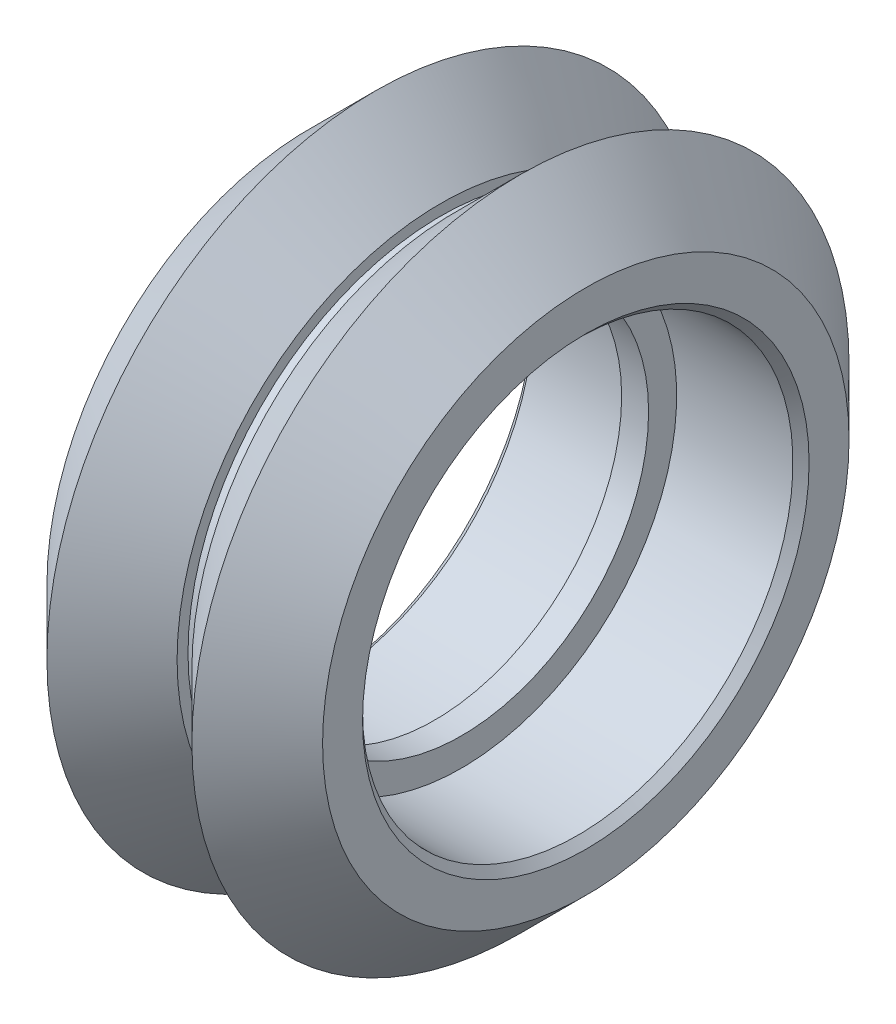
ISO-10303-21;
HEADER;
FILE_DESCRIPTION(('STEP AP214'),'2;1');
FILE_NAME('part.step','',(''),(''),'','','');
FILE_SCHEMA(('AUTOMOTIVE_DESIGN { 1 0 10303 214 1 1 1 1 }'));
ENDSEC;
DATA;
#1=APPLICATION_CONTEXT('core data for automotive mechanical design processes');
#2=APPLICATION_PROTOCOL_DEFINITION('international standard','automotive_design',2000,#1);
#3=PRODUCT_CONTEXT('',#1,'mechanical');
#4=PRODUCT('Part','Part','',(#3));
#5=PRODUCT_RELATED_PRODUCT_CATEGORY('part','',(#4));
#6=PRODUCT_DEFINITION_FORMATION('','',#4);
#7=PRODUCT_DEFINITION_CONTEXT('part definition',#1,'design');
#8=PRODUCT_DEFINITION('design','',#6,#7);
#9=PRODUCT_DEFINITION_SHAPE('','',#8);
#10=(LENGTH_UNIT() NAMED_UNIT(*) SI_UNIT(.MILLI.,.METRE.));
#11=(NAMED_UNIT(*) PLANE_ANGLE_UNIT() SI_UNIT($,.RADIAN.));
#12=(NAMED_UNIT(*) SI_UNIT($,.STERADIAN.) SOLID_ANGLE_UNIT());
#13=UNCERTAINTY_MEASURE_WITH_UNIT(LENGTH_MEASURE(1.E-05),#10,'distance_accuracy_value','');
#14=(GEOMETRIC_REPRESENTATION_CONTEXT(3) GLOBAL_UNCERTAINTY_ASSIGNED_CONTEXT((#13)) GLOBAL_UNIT_ASSIGNED_CONTEXT((#10,
#11,#12)) REPRESENTATION_CONTEXT('',''));
#15=CARTESIAN_POINT('',(0.,0.,0.));
#16=DIRECTION('',(0.,0.,1.));
#17=DIRECTION('',(1.,0.,0.));
#18=AXIS2_PLACEMENT_3D('',#15,#16,#17);
#19=CARTESIAN_POINT('',(0.5,7.987,0.));
#20=DIRECTION('',(-1.,0.,0.));
#21=DIRECTION('',(0.,0.,1.));
#22=AXIS2_PLACEMENT_3D('',#19,#20,#21);
#23=PLANE('',#22);
#24=CARTESIAN_POINT('',(0.5,0.,0.));
#25=DIRECTION('',(-1.,0.,0.));
#26=DIRECTION('',(0.,0.,1.));
#27=AXIS2_PLACEMENT_3D('',#24,#25,#26);
#28=CIRCLE('',#27,7.987);
#29=CARTESIAN_POINT('',(0.5,0.,7.987));
#30=VERTEX_POINT('',#29);
#31=EDGE_CURVE('E83',#30,#30,#28,.T.);
#32=ORIENTED_EDGE('',*,*,#31,.F.);
#33=EDGE_LOOP('',(#32));
#34=FACE_BOUND('',#33,.T.);
#35=CARTESIAN_POINT('',(0.5,0.,0.));
#36=DIRECTION('',(-1.,0.,0.));
#37=DIRECTION('',(0.,0.,1.));
#38=AXIS2_PLACEMENT_3D('',#35,#36,#37);
#39=CIRCLE('',#38,6.945);
#40=CARTESIAN_POINT('',(0.5,0.,6.945));
#41=VERTEX_POINT('',#40);
#42=EDGE_CURVE('E50',#41,#41,#39,.T.);
#43=ORIENTED_EDGE('',*,*,#42,.T.);
#44=EDGE_LOOP('',(#43));
#45=FACE_BOUND('',#44,.T.);
#46=ADVANCED_FACE('F30',(#34,#45),#23,.F.);
#47=CARTESIAN_POINT('',(0.,0.,0.));
#48=DIRECTION('',(-1.,0.,0.));
#49=DIRECTION('',(0.,0.,1.));
#50=AXIS2_PLACEMENT_3D('',#47,#48,#49);
#51=CYLINDRICAL_SURFACE('',#50,6.945);
#52=ORIENTED_EDGE('',*,*,#42,.F.);
#53=EDGE_LOOP('',(#52));
#54=FACE_BOUND('',#53,.T.);
#55=CARTESIAN_POINT('',(-0.5,0.,0.));
#56=DIRECTION('',(-1.,0.,0.));
#57=DIRECTION('',(0.,0.,1.));
#58=AXIS2_PLACEMENT_3D('',#55,#56,#57);
#59=CIRCLE('',#58,6.945);
#60=CARTESIAN_POINT('',(-0.5,0.,6.945));
#61=VERTEX_POINT('',#60);
#62=EDGE_CURVE('E53',#61,#61,#59,.T.);
#63=ORIENTED_EDGE('',*,*,#62,.T.);
#64=EDGE_LOOP('',(#63));
#65=FACE_BOUND('',#64,.T.);
#66=ADVANCED_FACE('F91',(#54,#65),#51,.F.);
#67=CARTESIAN_POINT('',(-0.5,6.945,0.));
#68=DIRECTION('',(1.,0.,0.));
#69=DIRECTION('',(0.,0.,-1.));
#70=AXIS2_PLACEMENT_3D('',#67,#68,#69);
#71=PLANE('',#70);
#72=ORIENTED_EDGE('',*,*,#62,.F.);
#73=EDGE_LOOP('',(#72));
#74=FACE_BOUND('',#73,.T.);
#75=CARTESIAN_POINT('',(-0.5,0.,0.));
#76=DIRECTION('',(-1.,0.,0.));
#77=DIRECTION('',(0.,0.,1.));
#78=AXIS2_PLACEMENT_3D('',#75,#76,#77);
#79=CIRCLE('',#78,7.987);
#80=CARTESIAN_POINT('',(-0.5,0.,7.987));
#81=VERTEX_POINT('',#80);
#82=EDGE_CURVE('E56',#81,#81,#79,.T.);
#83=ORIENTED_EDGE('',*,*,#82,.T.);
#84=EDGE_LOOP('',(#83));
#85=FACE_BOUND('',#84,.T.);
#86=ADVANCED_FACE('F97',(#74,#85),#71,.F.);
#87=CARTESIAN_POINT('',(0.,0.,0.));
#88=DIRECTION('',(-1.,0.,0.));
#89=DIRECTION('',(0.,0.,1.));
#90=AXIS2_PLACEMENT_3D('',#87,#88,#89);
#91=CYLINDRICAL_SURFACE('',#90,7.987);
#92=CARTESIAN_POINT('',(-4.815,0.,0.));
#93=DIRECTION('',(1.,0.,0.));
#94=DIRECTION('',(0.,0.,-1.));
#95=AXIS2_PLACEMENT_3D('',#92,#93,#94);
#96=CIRCLE('',#95,7.987);
#97=CARTESIAN_POINT('',(-4.815,0.,-7.987));
#98=VERTEX_POINT('',#97);
#99=EDGE_CURVE('E37',#98,#98,#96,.F.);
#100=ORIENTED_EDGE('',*,*,#99,.T.);
#101=EDGE_LOOP('',(#100));
#102=FACE_BOUND('',#101,.T.);
#103=ORIENTED_EDGE('',*,*,#82,.F.);
#104=EDGE_LOOP('',(#103));
#105=FACE_BOUND('',#104,.T.);
#106=ADVANCED_FACE('F103',(#102,#105),#91,.F.);
#107=CARTESIAN_POINT('',(-5.115,7.987,0.));
#108=DIRECTION('',(1.,0.,0.));
#109=DIRECTION('',(0.,0.,-1.));
#110=AXIS2_PLACEMENT_3D('',#107,#108,#109);
#111=PLANE('',#110);
#112=CARTESIAN_POINT('',(-5.115,0.,0.));
#113=DIRECTION('',(1.,0.,0.));
#114=DIRECTION('',(0.,0.,-1.));
#115=AXIS2_PLACEMENT_3D('',#112,#113,#114);
#116=CIRCLE('',#115,8.287);
#117=CARTESIAN_POINT('',(-5.115,0.,-8.287));
#118=VERTEX_POINT('',#117);
#119=EDGE_CURVE('E10',#118,#118,#116,.T.);
#120=ORIENTED_EDGE('',*,*,#119,.T.);
#121=EDGE_LOOP('',(#120));
#122=FACE_BOUND('',#121,.T.);
#123=CARTESIAN_POINT('',(-5.115,0.,0.));
#124=DIRECTION('',(-1.,0.,0.));
#125=DIRECTION('',(0.,0.,1.));
#126=AXIS2_PLACEMENT_3D('',#123,#124,#125);
#127=CIRCLE('',#126,9.77);
#128=CARTESIAN_POINT('',(-5.115,0.,9.77));
#129=VERTEX_POINT('',#128);
#130=EDGE_CURVE('E59',#129,#129,#127,.T.);
#131=ORIENTED_EDGE('',*,*,#130,.T.);
#132=EDGE_LOOP('',(#131));
#133=FACE_BOUND('',#132,.T.);
#134=ADVANCED_FACE('F108',(#122,#133),#111,.F.);
#135=CARTESIAN_POINT('',(-2.68999999999999,0.,0.));
#136=DIRECTION('',(1.,0.,0.));
#137=DIRECTION('',(0.,0.,-1.));
#138=AXIS2_PLACEMENT_3D('',#135,#136,#137);
#139=CONICAL_SURFACE('',#138,12.195,0.785398163397446);
#140=ORIENTED_EDGE('',*,*,#130,.F.);
#141=EDGE_LOOP('',(#140));
#142=FACE_BOUND('',#141,.T.);
#143=CARTESIAN_POINT('',(-2.68999999999999,0.,0.));
#144=DIRECTION('',(-1.,0.,0.));
#145=DIRECTION('',(0.,0.,1.));
#146=AXIS2_PLACEMENT_3D('',#143,#144,#145);
#147=CIRCLE('',#146,12.195);
#148=CARTESIAN_POINT('',(-2.68999999999999,0.,12.195));
#149=VERTEX_POINT('',#148);
#150=EDGE_CURVE('E62',#149,#149,#147,.T.);
#151=ORIENTED_EDGE('',*,*,#150,.T.);
#152=EDGE_LOOP('',(#151));
#153=FACE_BOUND('',#152,.T.);
#154=ADVANCED_FACE('F113',(#142,#153),#139,.T.);
#155=CARTESIAN_POINT('',(-0.275,0.,0.));
#156=DIRECTION('',(-1.,0.,0.));
#157=DIRECTION('',(0.,0.,1.));
#158=AXIS2_PLACEMENT_3D('',#155,#156,#157);
#159=CONICAL_SURFACE('',#158,9.77999999999998,0.785398163397454);
#160=ORIENTED_EDGE('',*,*,#150,.F.);
#161=EDGE_LOOP('',(#160));
#162=FACE_BOUND('',#161,.T.);
#163=CARTESIAN_POINT('',(-0.275,0.,0.));
#164=DIRECTION('',(-1.,0.,0.));
#165=DIRECTION('',(0.,0.,1.));
#166=AXIS2_PLACEMENT_3D('',#163,#164,#165);
#167=CIRCLE('',#166,9.77999999999998);
#168=CARTESIAN_POINT('',(-0.275,0.,9.77999999999998));
#169=VERTEX_POINT('',#168);
#170=EDGE_CURVE('E65',#169,#169,#167,.T.);
#171=ORIENTED_EDGE('',*,*,#170,.T.);
#172=EDGE_LOOP('',(#171));
#173=FACE_BOUND('',#172,.T.);
#174=ADVANCED_FACE('F159',(#162,#173),#159,.T.);
#175=CARTESIAN_POINT('',(-0.275,9.77999999999998,0.));
#176=DIRECTION('',(-1.,0.,0.));
#177=DIRECTION('',(0.,0.,1.));
#178=AXIS2_PLACEMENT_3D('',#175,#176,#177);
#179=PLANE('',#178);
#180=ORIENTED_EDGE('',*,*,#170,.F.);
#181=EDGE_LOOP('',(#180));
#182=FACE_BOUND('',#181,.T.);
#183=CARTESIAN_POINT('',(-0.275,0.,0.));
#184=DIRECTION('',(-1.,0.,0.));
#185=DIRECTION('',(0.,0.,1.));
#186=AXIS2_PLACEMENT_3D('',#183,#184,#185);
#187=CIRCLE('',#186,9.375);
#188=CARTESIAN_POINT('',(-0.275,0.,9.375));
#189=VERTEX_POINT('',#188);
#190=EDGE_CURVE('E68',#189,#189,#187,.T.);
#191=ORIENTED_EDGE('',*,*,#190,.T.);
#192=EDGE_LOOP('',(#191));
#193=FACE_BOUND('',#192,.T.);
#194=ADVANCED_FACE('F155',(#182,#193),#179,.F.);
#195=CARTESIAN_POINT('',(0.,0.,0.));
#196=DIRECTION('',(-1.,0.,0.));
#197=DIRECTION('',(0.,0.,1.));
#198=AXIS2_PLACEMENT_3D('',#195,#196,#197);
#199=CYLINDRICAL_SURFACE('',#198,9.375);
#200=ORIENTED_EDGE('',*,*,#190,.F.);
#201=EDGE_LOOP('',(#200));
#202=FACE_BOUND('',#201,.T.);
#203=CARTESIAN_POINT('',(0.275,0.,0.));
#204=DIRECTION('',(-1.,0.,0.));
#205=DIRECTION('',(0.,0.,1.));
#206=AXIS2_PLACEMENT_3D('',#203,#204,#205);
#207=CIRCLE('',#206,9.375);
#208=CARTESIAN_POINT('',(0.275,0.,9.375));
#209=VERTEX_POINT('',#208);
#210=EDGE_CURVE('E71',#209,#209,#207,.T.);
#211=ORIENTED_EDGE('',*,*,#210,.T.);
#212=EDGE_LOOP('',(#211));
#213=FACE_BOUND('',#212,.T.);
#214=ADVANCED_FACE('F151',(#202,#213),#199,.T.);
#215=CARTESIAN_POINT('',(0.275,9.375,0.));
#216=DIRECTION('',(1.,0.,0.));
#217=DIRECTION('',(0.,0.,-1.));
#218=AXIS2_PLACEMENT_3D('',#215,#216,#217);
#219=PLANE('',#218);
#220=ORIENTED_EDGE('',*,*,#210,.F.);
#221=EDGE_LOOP('',(#220));
#222=FACE_BOUND('',#221,.T.);
#223=CARTESIAN_POINT('',(0.275,0.,0.));
#224=DIRECTION('',(-1.,0.,0.));
#225=DIRECTION('',(0.,0.,1.));
#226=AXIS2_PLACEMENT_3D('',#223,#224,#225);
#227=CIRCLE('',#226,9.77999999999999);
#228=CARTESIAN_POINT('',(0.275,0.,9.77999999999999));
#229=VERTEX_POINT('',#228);
#230=EDGE_CURVE('E74',#229,#229,#227,.T.);
#231=ORIENTED_EDGE('',*,*,#230,.T.);
#232=EDGE_LOOP('',(#231));
#233=FACE_BOUND('',#232,.T.);
#234=ADVANCED_FACE('F144',(#222,#233),#219,.F.);
#235=CARTESIAN_POINT('',(2.69000000000002,0.,0.));
#236=DIRECTION('',(1.,0.,0.));
#237=DIRECTION('',(0.,0.,-1.));
#238=AXIS2_PLACEMENT_3D('',#235,#236,#237);
#239=CONICAL_SURFACE('',#238,12.195,0.785398163397447);
#240=ORIENTED_EDGE('',*,*,#230,.F.);
#241=EDGE_LOOP('',(#240));
#242=FACE_BOUND('',#241,.T.);
#243=CARTESIAN_POINT('',(2.69000000000002,0.,0.));
#244=DIRECTION('',(-1.,0.,0.));
#245=DIRECTION('',(0.,0.,1.));
#246=AXIS2_PLACEMENT_3D('',#243,#244,#245);
#247=CIRCLE('',#246,12.195);
#248=CARTESIAN_POINT('',(2.69000000000002,0.,12.195));
#249=VERTEX_POINT('',#248);
#250=EDGE_CURVE('E77',#249,#249,#247,.T.);
#251=ORIENTED_EDGE('',*,*,#250,.T.);
#252=EDGE_LOOP('',(#251));
#253=FACE_BOUND('',#252,.T.);
#254=ADVANCED_FACE('F138',(#242,#253),#239,.T.);
#255=CARTESIAN_POINT('',(5.115,0.,0.));
#256=DIRECTION('',(-1.,0.,0.));
#257=DIRECTION('',(0.,0.,1.));
#258=AXIS2_PLACEMENT_3D('',#255,#256,#257);
#259=CONICAL_SURFACE('',#258,9.77,0.785398163397453);
#260=ORIENTED_EDGE('',*,*,#250,.F.);
#261=EDGE_LOOP('',(#260));
#262=FACE_BOUND('',#261,.T.);
#263=CARTESIAN_POINT('',(5.115,0.,0.));
#264=DIRECTION('',(-1.,0.,0.));
#265=DIRECTION('',(0.,0.,1.));
#266=AXIS2_PLACEMENT_3D('',#263,#264,#265);
#267=CIRCLE('',#266,9.77);
#268=CARTESIAN_POINT('',(5.115,0.,9.77));
#269=VERTEX_POINT('',#268);
#270=EDGE_CURVE('E80',#269,#269,#267,.T.);
#271=ORIENTED_EDGE('',*,*,#270,.T.);
#272=EDGE_LOOP('',(#271));
#273=FACE_BOUND('',#272,.T.);
#274=ADVANCED_FACE('F133',(#262,#273),#259,.T.);
#275=CARTESIAN_POINT('',(5.115,9.77,0.));
#276=DIRECTION('',(-1.,0.,0.));
#277=DIRECTION('',(0.,0.,1.));
#278=AXIS2_PLACEMENT_3D('',#275,#276,#277);
#279=PLANE('',#278);
#280=CARTESIAN_POINT('',(5.115,0.,0.));
#281=DIRECTION('',(-1.,0.,0.));
#282=DIRECTION('',(0.,0.,1.));
#283=AXIS2_PLACEMENT_3D('',#280,#281,#282);
#284=CIRCLE('',#283,8.287);
#285=CARTESIAN_POINT('',(5.115,0.,8.287));
#286=VERTEX_POINT('',#285);
#287=EDGE_CURVE('E45',#286,#286,#284,.T.);
#288=ORIENTED_EDGE('',*,*,#287,.T.);
#289=EDGE_LOOP('',(#288));
#290=FACE_BOUND('',#289,.T.);
#291=ORIENTED_EDGE('',*,*,#270,.F.);
#292=EDGE_LOOP('',(#291));
#293=FACE_BOUND('',#292,.T.);
#294=ADVANCED_FACE('F124',(#290,#293),#279,.F.);
#295=CARTESIAN_POINT('',(0.,0.,0.));
#296=DIRECTION('',(-1.,0.,0.));
#297=DIRECTION('',(0.,0.,1.));
#298=AXIS2_PLACEMENT_3D('',#295,#296,#297);
#299=CYLINDRICAL_SURFACE('',#298,7.987);
#300=CARTESIAN_POINT('',(4.81499999999999,0.,0.));
#301=DIRECTION('',(-1.,0.,0.));
#302=DIRECTION('',(0.,0.,1.));
#303=AXIS2_PLACEMENT_3D('',#300,#301,#302);
#304=CIRCLE('',#303,7.987);
#305=CARTESIAN_POINT('',(4.81499999999999,0.,7.987));
#306=VERTEX_POINT('',#305);
#307=EDGE_CURVE('E41',#306,#306,#304,.F.);
#308=ORIENTED_EDGE('',*,*,#307,.T.);
#309=EDGE_LOOP('',(#308));
#310=FACE_BOUND('',#309,.T.);
#311=ORIENTED_EDGE('',*,*,#31,.T.);
#312=EDGE_LOOP('',(#311));
#313=FACE_BOUND('',#312,.T.);
#314=ADVANCED_FACE('F87',(#310,#313),#299,.F.);
#315=CARTESIAN_POINT('',(5.115,0.,0.));
#316=DIRECTION('',(1.,0.,0.));
#317=DIRECTION('',(0.,0.,-1.));
#318=AXIS2_PLACEMENT_3D('',#315,#316,#317);
#319=CONICAL_SURFACE('',#318,8.287,0.785398163397446);
#320=ORIENTED_EDGE('',*,*,#307,.F.);
#321=EDGE_LOOP('',(#320));
#322=FACE_BOUND('',#321,.T.);
#323=ORIENTED_EDGE('',*,*,#287,.F.);
#324=EDGE_LOOP('',(#323));
#325=FACE_BOUND('',#324,.T.);
#326=ADVANCED_FACE('F116',(#322,#325),#319,.F.);
#327=CARTESIAN_POINT('',(-4.815,0.,0.));
#328=DIRECTION('',(-1.,0.,0.));
#329=DIRECTION('',(0.,0.,1.));
#330=AXIS2_PLACEMENT_3D('',#327,#328,#329);
#331=CONICAL_SURFACE('',#330,7.987,0.785398163397454);
#332=ORIENTED_EDGE('',*,*,#119,.F.);
#333=EDGE_LOOP('',(#332));
#334=FACE_BOUND('',#333,.T.);
#335=ORIENTED_EDGE('',*,*,#99,.F.);
#336=EDGE_LOOP('',(#335));
#337=FACE_BOUND('',#336,.T.);
#338=ADVANCED_FACE('F32',(#334,#337),#331,.F.);
#339=CLOSED_SHELL('',(#46,#66,#86,#106,#134,#154,#174,#194,#214,#234,#254,#274,#294,#314,#326,#338));
#340=MANIFOLD_SOLID_BREP('B2',#339);
#341=ADVANCED_BREP_SHAPE_REPRESENTATION('',(#18,#340),#14);
#342=SHAPE_DEFINITION_REPRESENTATION(#9,#341);
ENDSEC;
END-ISO-10303-21;
